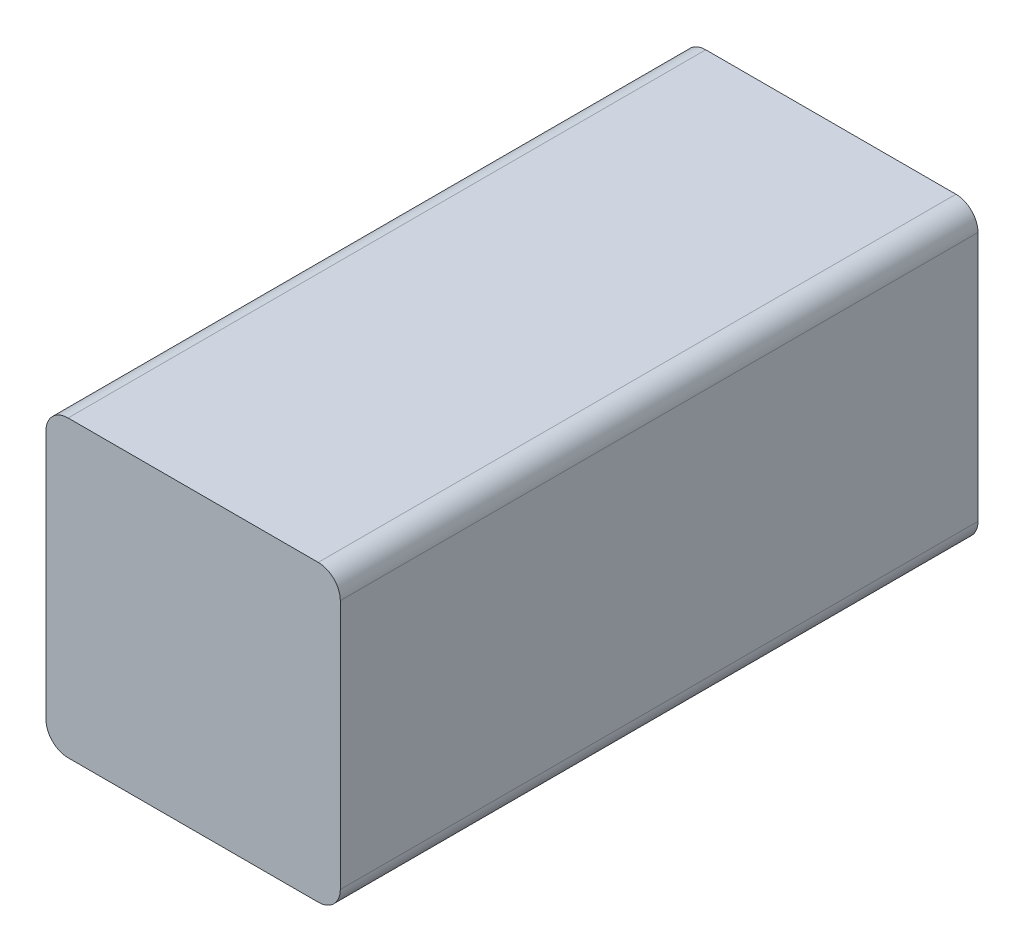
ISO-10303-21;
HEADER;
FILE_DESCRIPTION(('STEP AP214'),'2;1');
FILE_NAME('part.step','',(''),(''),'','','');
FILE_SCHEMA(('AUTOMOTIVE_DESIGN { 1 0 10303 214 1 1 1 1 }'));
ENDSEC;
DATA;
#1=APPLICATION_CONTEXT('core data for automotive mechanical design processes');
#2=APPLICATION_PROTOCOL_DEFINITION('international standard','automotive_design',2000,#1);
#3=PRODUCT_CONTEXT('',#1,'mechanical');
#4=PRODUCT('Part','Part','',(#3));
#5=PRODUCT_RELATED_PRODUCT_CATEGORY('part','',(#4));
#6=PRODUCT_DEFINITION_FORMATION('','',#4);
#7=PRODUCT_DEFINITION_CONTEXT('part definition',#1,'design');
#8=PRODUCT_DEFINITION('design','',#6,#7);
#9=PRODUCT_DEFINITION_SHAPE('','',#8);
#10=(LENGTH_UNIT() NAMED_UNIT(*) SI_UNIT(.MILLI.,.METRE.));
#11=(NAMED_UNIT(*) PLANE_ANGLE_UNIT() SI_UNIT($,.RADIAN.));
#12=(NAMED_UNIT(*) SI_UNIT($,.STERADIAN.) SOLID_ANGLE_UNIT());
#13=UNCERTAINTY_MEASURE_WITH_UNIT(LENGTH_MEASURE(1.E-05),#10,'distance_accuracy_value','');
#14=(GEOMETRIC_REPRESENTATION_CONTEXT(3) GLOBAL_UNCERTAINTY_ASSIGNED_CONTEXT((#13)) GLOBAL_UNIT_ASSIGNED_CONTEXT((#10,
#11,#12)) REPRESENTATION_CONTEXT('',''));
#15=CARTESIAN_POINT('',(0.,0.,0.));
#16=DIRECTION('',(0.,0.,1.));
#17=DIRECTION('',(1.,0.,0.));
#18=AXIS2_PLACEMENT_3D('',#15,#16,#17);
#19=CARTESIAN_POINT('',(12.75,12.75,65.));
#20=DIRECTION('',(0.,0.,-1.));
#21=DIRECTION('',(-1.,0.,0.));
#22=AXIS2_PLACEMENT_3D('',#19,#20,#21);
#23=CYLINDRICAL_SURFACE('',#22,2.25);
#24=CARTESIAN_POINT('',(12.75,12.75,0.));
#25=DIRECTION('',(0.,0.,1.));
#26=DIRECTION('',(-1.,0.,0.));
#27=AXIS2_PLACEMENT_3D('',#24,#25,#26);
#28=CIRCLE('',#27,2.25);
#29=CARTESIAN_POINT('',(15.,12.75,0.));
#30=VERTEX_POINT('',#29);
#31=CARTESIAN_POINT('',(12.75,15.,0.));
#32=VERTEX_POINT('',#31);
#33=EDGE_CURVE('E101',#30,#32,#28,.T.);
#34=ORIENTED_EDGE('',*,*,#33,.T.);
#35=DIRECTION('',(0.,0.,-1.));
#36=VECTOR('',#35,1.);
#37=CARTESIAN_POINT('',(12.75,15.,65.));
#38=LINE('',#37,#36);
#39=CARTESIAN_POINT('',(12.75,15.,65.));
#40=VERTEX_POINT('',#39);
#41=EDGE_CURVE('E11',#40,#32,#38,.T.);
#42=ORIENTED_EDGE('',*,*,#41,.F.);
#43=CARTESIAN_POINT('',(12.75,12.75,65.));
#44=DIRECTION('',(0.,0.,1.));
#45=DIRECTION('',(-1.,0.,0.));
#46=AXIS2_PLACEMENT_3D('',#43,#44,#45);
#47=CIRCLE('',#46,2.25);
#48=CARTESIAN_POINT('',(15.,12.75,65.));
#49=VERTEX_POINT('',#48);
#50=EDGE_CURVE('E128',#49,#40,#47,.T.);
#51=ORIENTED_EDGE('',*,*,#50,.F.);
#52=DIRECTION('',(0.,0.,-1.));
#53=VECTOR('',#52,1.);
#54=CARTESIAN_POINT('',(15.,12.75,65.));
#55=LINE('',#54,#53);
#56=EDGE_CURVE('E114',#49,#30,#55,.T.);
#57=ORIENTED_EDGE('',*,*,#56,.T.);
#58=EDGE_LOOP('',(#34,#42,#51,#57));
#59=FACE_BOUND('',#58,.T.);
#60=ADVANCED_FACE('F33',(#59),#23,.T.);
#61=CARTESIAN_POINT('',(-12.75,15.,65.));
#62=DIRECTION('',(0.,-1.,0.));
#63=DIRECTION('',(0.,0.,-1.));
#64=AXIS2_PLACEMENT_3D('',#61,#62,#63);
#65=PLANE('',#64);
#66=DIRECTION('',(-1.,0.,0.));
#67=VECTOR('',#66,1.);
#68=CARTESIAN_POINT('',(-12.75,15.,0.));
#69=LINE('',#68,#67);
#70=CARTESIAN_POINT('',(-12.75,15.,0.));
#71=VERTEX_POINT('',#70);
#72=EDGE_CURVE('E97',#32,#71,#69,.T.);
#73=ORIENTED_EDGE('',*,*,#72,.T.);
#74=DIRECTION('',(0.,0.,-1.));
#75=VECTOR('',#74,1.);
#76=CARTESIAN_POINT('',(-12.75,15.,65.));
#77=LINE('',#76,#75);
#78=CARTESIAN_POINT('',(-12.75,15.,65.));
#79=VERTEX_POINT('',#78);
#80=EDGE_CURVE('E40',#79,#71,#77,.T.);
#81=ORIENTED_EDGE('',*,*,#80,.F.);
#82=DIRECTION('',(-1.,0.,0.));
#83=VECTOR('',#82,1.);
#84=CARTESIAN_POINT('',(-12.75,15.,65.));
#85=LINE('',#84,#83);
#86=EDGE_CURVE('E110',#40,#79,#85,.T.);
#87=ORIENTED_EDGE('',*,*,#86,.F.);
#88=ORIENTED_EDGE('',*,*,#41,.T.);
#89=EDGE_LOOP('',(#73,#81,#87,#88));
#90=FACE_BOUND('',#89,.T.);
#91=ADVANCED_FACE('F109',(#90),#65,.F.);
#92=CARTESIAN_POINT('',(-12.75,12.75,65.));
#93=DIRECTION('',(0.,0.,-1.));
#94=DIRECTION('',(-1.,0.,0.));
#95=AXIS2_PLACEMENT_3D('',#92,#93,#94);
#96=CYLINDRICAL_SURFACE('',#95,2.25);
#97=CARTESIAN_POINT('',(-12.75,12.75,0.));
#98=DIRECTION('',(0.,0.,1.));
#99=DIRECTION('',(1.,0.,0.));
#100=AXIS2_PLACEMENT_3D('',#97,#98,#99);
#101=CIRCLE('',#100,2.25);
#102=CARTESIAN_POINT('',(-15.,12.75,0.));
#103=VERTEX_POINT('',#102);
#104=EDGE_CURVE('E103',#71,#103,#101,.T.);
#105=ORIENTED_EDGE('',*,*,#104,.T.);
#106=DIRECTION('',(0.,0.,-1.));
#107=VECTOR('',#106,1.);
#108=CARTESIAN_POINT('',(-15.,12.75,65.));
#109=LINE('',#108,#107);
#110=CARTESIAN_POINT('',(-15.,12.75,65.));
#111=VERTEX_POINT('',#110);
#112=EDGE_CURVE('E154',#111,#103,#109,.T.);
#113=ORIENTED_EDGE('',*,*,#112,.F.);
#114=CARTESIAN_POINT('',(-12.75,12.75,65.));
#115=DIRECTION('',(0.,0.,1.));
#116=DIRECTION('',(1.,0.,0.));
#117=AXIS2_PLACEMENT_3D('',#114,#115,#116);
#118=CIRCLE('',#117,2.25);
#119=EDGE_CURVE('E131',#79,#111,#118,.T.);
#120=ORIENTED_EDGE('',*,*,#119,.F.);
#121=ORIENTED_EDGE('',*,*,#80,.T.);
#122=EDGE_LOOP('',(#105,#113,#120,#121));
#123=FACE_BOUND('',#122,.T.);
#124=ADVANCED_FACE('F158',(#123),#96,.T.);
#125=CARTESIAN_POINT('',(-15.,12.75,65.));
#126=DIRECTION('',(1.,0.,0.));
#127=DIRECTION('',(0.,0.,-1.));
#128=AXIS2_PLACEMENT_3D('',#125,#126,#127);
#129=PLANE('',#128);
#130=DIRECTION('',(0.,-1.,0.));
#131=VECTOR('',#130,1.);
#132=CARTESIAN_POINT('',(-15.,12.75,0.));
#133=LINE('',#132,#131);
#134=CARTESIAN_POINT('',(-15.,-12.75,0.));
#135=VERTEX_POINT('',#134);
#136=EDGE_CURVE('E118',#103,#135,#133,.T.);
#137=ORIENTED_EDGE('',*,*,#136,.T.);
#138=DIRECTION('',(0.,0.,-1.));
#139=VECTOR('',#138,1.);
#140=CARTESIAN_POINT('',(-15.,-12.75,65.));
#141=LINE('',#140,#139);
#142=CARTESIAN_POINT('',(-15.,-12.75,65.));
#143=VERTEX_POINT('',#142);
#144=EDGE_CURVE('E151',#143,#135,#141,.T.);
#145=ORIENTED_EDGE('',*,*,#144,.F.);
#146=DIRECTION('',(0.,-1.,0.));
#147=VECTOR('',#146,1.);
#148=CARTESIAN_POINT('',(-15.,12.75,65.));
#149=LINE('',#148,#147);
#150=EDGE_CURVE('E133',#111,#143,#149,.T.);
#151=ORIENTED_EDGE('',*,*,#150,.F.);
#152=ORIENTED_EDGE('',*,*,#112,.T.);
#153=EDGE_LOOP('',(#137,#145,#151,#152));
#154=FACE_BOUND('',#153,.T.);
#155=ADVANCED_FACE('F166',(#154),#129,.F.);
#156=CARTESIAN_POINT('',(-12.75,-12.75,65.));
#157=DIRECTION('',(0.,0.,-1.));
#158=DIRECTION('',(-1.,0.,0.));
#159=AXIS2_PLACEMENT_3D('',#156,#157,#158);
#160=CYLINDRICAL_SURFACE('',#159,2.25);
#161=CARTESIAN_POINT('',(-12.75,-12.75,0.));
#162=DIRECTION('',(0.,0.,1.));
#163=DIRECTION('',(-1.,0.,0.));
#164=AXIS2_PLACEMENT_3D('',#161,#162,#163);
#165=CIRCLE('',#164,2.25);
#166=CARTESIAN_POINT('',(-12.75,-15.,0.));
#167=VERTEX_POINT('',#166);
#168=EDGE_CURVE('E120',#135,#167,#165,.T.);
#169=ORIENTED_EDGE('',*,*,#168,.T.);
#170=DIRECTION('',(0.,0.,-1.));
#171=VECTOR('',#170,1.);
#172=CARTESIAN_POINT('',(-12.75,-15.,65.));
#173=LINE('',#172,#171);
#174=CARTESIAN_POINT('',(-12.75,-15.,65.));
#175=VERTEX_POINT('',#174);
#176=EDGE_CURVE('E148',#175,#167,#173,.T.);
#177=ORIENTED_EDGE('',*,*,#176,.F.);
#178=CARTESIAN_POINT('',(-12.75,-12.75,65.));
#179=DIRECTION('',(0.,0.,1.));
#180=DIRECTION('',(-1.,0.,0.));
#181=AXIS2_PLACEMENT_3D('',#178,#179,#180);
#182=CIRCLE('',#181,2.25);
#183=EDGE_CURVE('E135',#143,#175,#182,.T.);
#184=ORIENTED_EDGE('',*,*,#183,.F.);
#185=ORIENTED_EDGE('',*,*,#144,.T.);
#186=EDGE_LOOP('',(#169,#177,#184,#185));
#187=FACE_BOUND('',#186,.T.);
#188=ADVANCED_FACE('F169',(#187),#160,.T.);
#189=CARTESIAN_POINT('',(-12.75,-15.,65.));
#190=DIRECTION('',(0.,1.,0.));
#191=DIRECTION('',(0.,0.,1.));
#192=AXIS2_PLACEMENT_3D('',#189,#190,#191);
#193=PLANE('',#192);
#194=DIRECTION('',(1.,0.,0.));
#195=VECTOR('',#194,1.);
#196=CARTESIAN_POINT('',(-12.75,-15.,0.));
#197=LINE('',#196,#195);
#198=CARTESIAN_POINT('',(12.75,-15.,0.));
#199=VERTEX_POINT('',#198);
#200=EDGE_CURVE('E122',#167,#199,#197,.T.);
#201=ORIENTED_EDGE('',*,*,#200,.T.);
#202=DIRECTION('',(0.,0.,-1.));
#203=VECTOR('',#202,1.);
#204=CARTESIAN_POINT('',(12.75,-15.,65.));
#205=LINE('',#204,#203);
#206=CARTESIAN_POINT('',(12.75,-15.,65.));
#207=VERTEX_POINT('',#206);
#208=EDGE_CURVE('E145',#207,#199,#205,.T.);
#209=ORIENTED_EDGE('',*,*,#208,.F.);
#210=DIRECTION('',(1.,0.,0.));
#211=VECTOR('',#210,1.);
#212=CARTESIAN_POINT('',(-12.75,-15.,65.));
#213=LINE('',#212,#211);
#214=EDGE_CURVE('E137',#175,#207,#213,.T.);
#215=ORIENTED_EDGE('',*,*,#214,.F.);
#216=ORIENTED_EDGE('',*,*,#176,.T.);
#217=EDGE_LOOP('',(#201,#209,#215,#216));
#218=FACE_BOUND('',#217,.T.);
#219=ADVANCED_FACE('F174',(#218),#193,.F.);
#220=CARTESIAN_POINT('',(12.75,-12.75,65.));
#221=DIRECTION('',(0.,0.,-1.));
#222=DIRECTION('',(-1.,0.,0.));
#223=AXIS2_PLACEMENT_3D('',#220,#221,#222);
#224=CYLINDRICAL_SURFACE('',#223,2.25);
#225=CARTESIAN_POINT('',(12.75,-12.75,0.));
#226=DIRECTION('',(0.,0.,1.));
#227=DIRECTION('',(1.,0.,0.));
#228=AXIS2_PLACEMENT_3D('',#225,#226,#227);
#229=CIRCLE('',#228,2.25);
#230=CARTESIAN_POINT('',(15.,-12.75,0.));
#231=VERTEX_POINT('',#230);
#232=EDGE_CURVE('E124',#199,#231,#229,.T.);
#233=ORIENTED_EDGE('',*,*,#232,.T.);
#234=DIRECTION('',(0.,0.,-1.));
#235=VECTOR('',#234,1.);
#236=CARTESIAN_POINT('',(15.,-12.75,65.));
#237=LINE('',#236,#235);
#238=CARTESIAN_POINT('',(15.,-12.75,65.));
#239=VERTEX_POINT('',#238);
#240=EDGE_CURVE('E142',#239,#231,#237,.T.);
#241=ORIENTED_EDGE('',*,*,#240,.F.);
#242=CARTESIAN_POINT('',(12.75,-12.75,65.));
#243=DIRECTION('',(0.,0.,1.));
#244=DIRECTION('',(1.,0.,0.));
#245=AXIS2_PLACEMENT_3D('',#242,#243,#244);
#246=CIRCLE('',#245,2.25);
#247=EDGE_CURVE('E52',#207,#239,#246,.T.);
#248=ORIENTED_EDGE('',*,*,#247,.F.);
#249=ORIENTED_EDGE('',*,*,#208,.T.);
#250=EDGE_LOOP('',(#233,#241,#248,#249));
#251=FACE_BOUND('',#250,.T.);
#252=ADVANCED_FACE('F177',(#251),#224,.T.);
#253=CARTESIAN_POINT('',(15.,12.75,65.));
#254=DIRECTION('',(-1.,0.,0.));
#255=DIRECTION('',(0.,0.,1.));
#256=AXIS2_PLACEMENT_3D('',#253,#254,#255);
#257=PLANE('',#256);
#258=DIRECTION('',(0.,1.,0.));
#259=VECTOR('',#258,1.);
#260=CARTESIAN_POINT('',(15.,12.75,0.));
#261=LINE('',#260,#259);
#262=EDGE_CURVE('E126',#231,#30,#261,.T.);
#263=ORIENTED_EDGE('',*,*,#262,.T.);
#264=ORIENTED_EDGE('',*,*,#56,.F.);
#265=DIRECTION('',(0.,1.,0.));
#266=VECTOR('',#265,1.);
#267=CARTESIAN_POINT('',(15.,12.75,65.));
#268=LINE('',#267,#266);
#269=EDGE_CURVE('E47',#239,#49,#268,.T.);
#270=ORIENTED_EDGE('',*,*,#269,.F.);
#271=ORIENTED_EDGE('',*,*,#240,.T.);
#272=EDGE_LOOP('',(#263,#264,#270,#271));
#273=FACE_BOUND('',#272,.T.);
#274=ADVANCED_FACE('F179',(#273),#257,.F.);
#275=CARTESIAN_POINT('',(12.75,12.75,65.));
#276=DIRECTION('',(0.,0.,-1.));
#277=DIRECTION('',(-1.,0.,0.));
#278=AXIS2_PLACEMENT_3D('',#275,#276,#277);
#279=PLANE('',#278);
#280=ORIENTED_EDGE('',*,*,#50,.T.);
#281=ORIENTED_EDGE('',*,*,#86,.T.);
#282=ORIENTED_EDGE('',*,*,#119,.T.);
#283=ORIENTED_EDGE('',*,*,#150,.T.);
#284=ORIENTED_EDGE('',*,*,#183,.T.);
#285=ORIENTED_EDGE('',*,*,#214,.T.);
#286=ORIENTED_EDGE('',*,*,#247,.T.);
#287=ORIENTED_EDGE('',*,*,#269,.T.);
#288=EDGE_LOOP('',(#280,#281,#282,#283,#284,#285,#286,#287));
#289=FACE_BOUND('',#288,.T.);
#290=ADVANCED_FACE('F161',(#289),#279,.F.);
#291=CARTESIAN_POINT('',(12.75,12.75,0.));
#292=DIRECTION('',(0.,0.,-1.));
#293=DIRECTION('',(-1.,0.,0.));
#294=AXIS2_PLACEMENT_3D('',#291,#292,#293);
#295=PLANE('',#294);
#296=ORIENTED_EDGE('',*,*,#33,.F.);
#297=ORIENTED_EDGE('',*,*,#262,.F.);
#298=ORIENTED_EDGE('',*,*,#232,.F.);
#299=ORIENTED_EDGE('',*,*,#200,.F.);
#300=ORIENTED_EDGE('',*,*,#168,.F.);
#301=ORIENTED_EDGE('',*,*,#136,.F.);
#302=ORIENTED_EDGE('',*,*,#104,.F.);
#303=ORIENTED_EDGE('',*,*,#72,.F.);
#304=EDGE_LOOP('',(#296,#297,#298,#299,#300,#301,#302,#303));
#305=FACE_BOUND('',#304,.T.);
#306=ADVANCED_FACE('F98',(#305),#295,.T.);
#307=CLOSED_SHELL('',(#60,#91,#124,#155,#188,#219,#252,#274,#290,#306));
#308=MANIFOLD_SOLID_BREP('B2',#307);
#309=ADVANCED_BREP_SHAPE_REPRESENTATION('',(#18,#308),#14);
#310=SHAPE_DEFINITION_REPRESENTATION(#9,#309);
ENDSEC;
END-ISO-10303-21;
